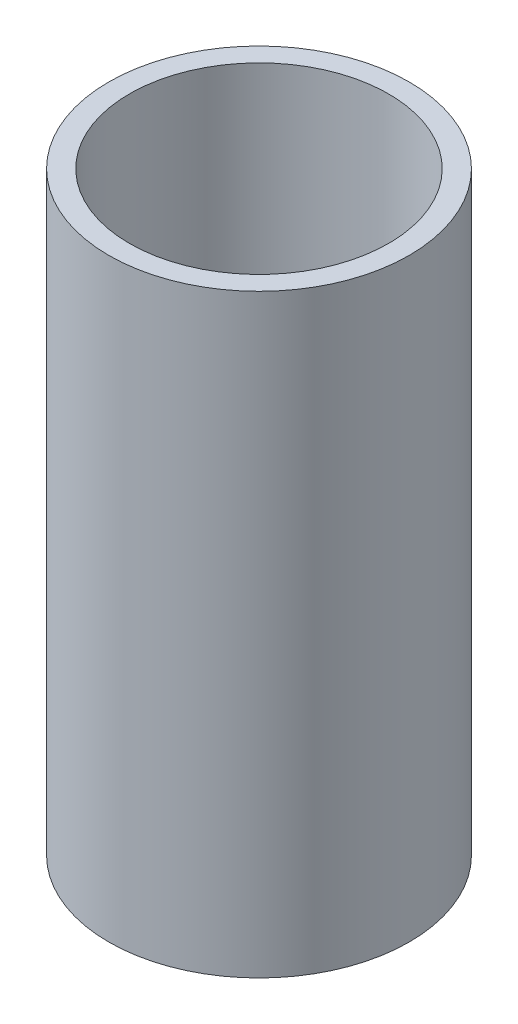
ISO-10303-21;
HEADER;
FILE_DESCRIPTION(('STEP AP214'),'2;1');
FILE_NAME('part.step','',(''),(''),'','','');
FILE_SCHEMA(('AUTOMOTIVE_DESIGN { 1 0 10303 214 1 1 1 1 }'));
ENDSEC;
DATA;
#1=APPLICATION_CONTEXT('core data for automotive mechanical design processes');
#2=APPLICATION_PROTOCOL_DEFINITION('international standard','automotive_design',2000,#1);
#3=PRODUCT_CONTEXT('',#1,'mechanical');
#4=PRODUCT('Part','Part','',(#3));
#5=PRODUCT_RELATED_PRODUCT_CATEGORY('part','',(#4));
#6=PRODUCT_DEFINITION_FORMATION('','',#4);
#7=PRODUCT_DEFINITION_CONTEXT('part definition',#1,'design');
#8=PRODUCT_DEFINITION('design','',#6,#7);
#9=PRODUCT_DEFINITION_SHAPE('','',#8);
#10=(LENGTH_UNIT() NAMED_UNIT(*) SI_UNIT(.MILLI.,.METRE.));
#11=(NAMED_UNIT(*) PLANE_ANGLE_UNIT() SI_UNIT($,.RADIAN.));
#12=(NAMED_UNIT(*) SI_UNIT($,.STERADIAN.) SOLID_ANGLE_UNIT());
#13=UNCERTAINTY_MEASURE_WITH_UNIT(LENGTH_MEASURE(1.E-05),#10,'distance_accuracy_value','');
#14=(GEOMETRIC_REPRESENTATION_CONTEXT(3) GLOBAL_UNCERTAINTY_ASSIGNED_CONTEXT((#13)) GLOBAL_UNIT_ASSIGNED_CONTEXT((#10,
#11,#12)) REPRESENTATION_CONTEXT('',''));
#15=CARTESIAN_POINT('',(0.,0.,0.));
#16=DIRECTION('',(0.,0.,1.));
#17=DIRECTION('',(1.,0.,0.));
#18=AXIS2_PLACEMENT_3D('',#15,#16,#17);
#19=CARTESIAN_POINT('',(0.,168.237401892509,0.));
#20=DIRECTION('',(0.,-1.,0.));
#21=DIRECTION('',(0.,0.,-1.));
#22=AXIS2_PLACEMENT_3D('',#19,#20,#21);
#23=CYLINDRICAL_SURFACE('',#22,42.5);
#24=CARTESIAN_POINT('',(0.,168.237401892509,0.));
#25=DIRECTION('',(0.,1.,0.));
#26=DIRECTION('',(0.,0.,1.));
#27=AXIS2_PLACEMENT_3D('',#24,#25,#26);
#28=CIRCLE('',#27,42.5);
#29=CARTESIAN_POINT('',(0.,168.237401892509,42.5));
#30=VERTEX_POINT('',#29);
#31=EDGE_CURVE('E10',#30,#30,#28,.T.);
#32=ORIENTED_EDGE('',*,*,#31,.F.);
#33=EDGE_LOOP('',(#32));
#34=FACE_BOUND('',#33,.T.);
#35=CARTESIAN_POINT('',(0.,0.,0.));
#36=DIRECTION('',(0.,1.,0.));
#37=DIRECTION('',(0.,0.,1.));
#38=AXIS2_PLACEMENT_3D('',#35,#36,#37);
#39=CIRCLE('',#38,42.5);
#40=CARTESIAN_POINT('',(0.,0.,42.5));
#41=VERTEX_POINT('',#40);
#42=EDGE_CURVE('E37',#41,#41,#39,.T.);
#43=ORIENTED_EDGE('',*,*,#42,.T.);
#44=EDGE_LOOP('',(#43));
#45=FACE_BOUND('',#44,.T.);
#46=ADVANCED_FACE('F40',(#34,#45),#23,.T.);
#47=CARTESIAN_POINT('',(0.,168.237401892509,0.));
#48=DIRECTION('',(0.,1.,0.));
#49=DIRECTION('',(0.,0.,1.));
#50=AXIS2_PLACEMENT_3D('',#47,#48,#49);
#51=PLANE('',#50);
#52=CARTESIAN_POINT('',(0.,168.237401892509,0.));
#53=DIRECTION('',(0.,1.,0.));
#54=DIRECTION('',(0.,0.,1.));
#55=AXIS2_PLACEMENT_3D('',#52,#53,#54);
#56=CIRCLE('',#55,36.6583887701762);
#57=CARTESIAN_POINT('',(0.,168.237401892509,36.6583887701762));
#58=VERTEX_POINT('',#57);
#59=EDGE_CURVE('E50',#58,#58,#56,.T.);
#60=ORIENTED_EDGE('',*,*,#59,.F.);
#61=EDGE_LOOP('',(#60));
#62=FACE_BOUND('',#61,.T.);
#63=ORIENTED_EDGE('',*,*,#31,.T.);
#64=EDGE_LOOP('',(#63));
#65=FACE_BOUND('',#64,.T.);
#66=ADVANCED_FACE('F59',(#62,#65),#51,.T.);
#67=CARTESIAN_POINT('',(0.,0.,0.));
#68=DIRECTION('',(0.,1.,0.));
#69=DIRECTION('',(0.,0.,1.));
#70=AXIS2_PLACEMENT_3D('',#67,#68,#69);
#71=PLANE('',#70);
#72=CARTESIAN_POINT('',(0.,0.,0.));
#73=DIRECTION('',(0.,1.,0.));
#74=DIRECTION('',(0.,0.,1.));
#75=AXIS2_PLACEMENT_3D('',#72,#73,#74);
#76=CIRCLE('',#75,36.6583887701762);
#77=CARTESIAN_POINT('',(0.,0.,36.6583887701762));
#78=VERTEX_POINT('',#77);
#79=EDGE_CURVE('E47',#78,#78,#76,.T.);
#80=ORIENTED_EDGE('',*,*,#79,.T.);
#81=EDGE_LOOP('',(#80));
#82=FACE_BOUND('',#81,.T.);
#83=ORIENTED_EDGE('',*,*,#42,.F.);
#84=EDGE_LOOP('',(#83));
#85=FACE_BOUND('',#84,.T.);
#86=ADVANCED_FACE('F58',(#82,#85),#71,.F.);
#87=CARTESIAN_POINT('',(0.,168.237401892509,0.));
#88=DIRECTION('',(0.,-1.,0.));
#89=DIRECTION('',(0.,0.,-1.));
#90=AXIS2_PLACEMENT_3D('',#87,#88,#89);
#91=CYLINDRICAL_SURFACE('',#90,36.6583887701762);
#92=ORIENTED_EDGE('',*,*,#59,.T.);
#93=EDGE_LOOP('',(#92));
#94=FACE_BOUND('',#93,.T.);
#95=ORIENTED_EDGE('',*,*,#79,.F.);
#96=EDGE_LOOP('',(#95));
#97=FACE_BOUND('',#96,.T.);
#98=ADVANCED_FACE('F54',(#94,#97),#91,.F.);
#99=CLOSED_SHELL('',(#46,#66,#86,#98));
#100=MANIFOLD_SOLID_BREP('B2',#99);
#101=ADVANCED_BREP_SHAPE_REPRESENTATION('',(#18,#100),#14);
#102=SHAPE_DEFINITION_REPRESENTATION(#9,#101);
ENDSEC;
END-ISO-10303-21;
